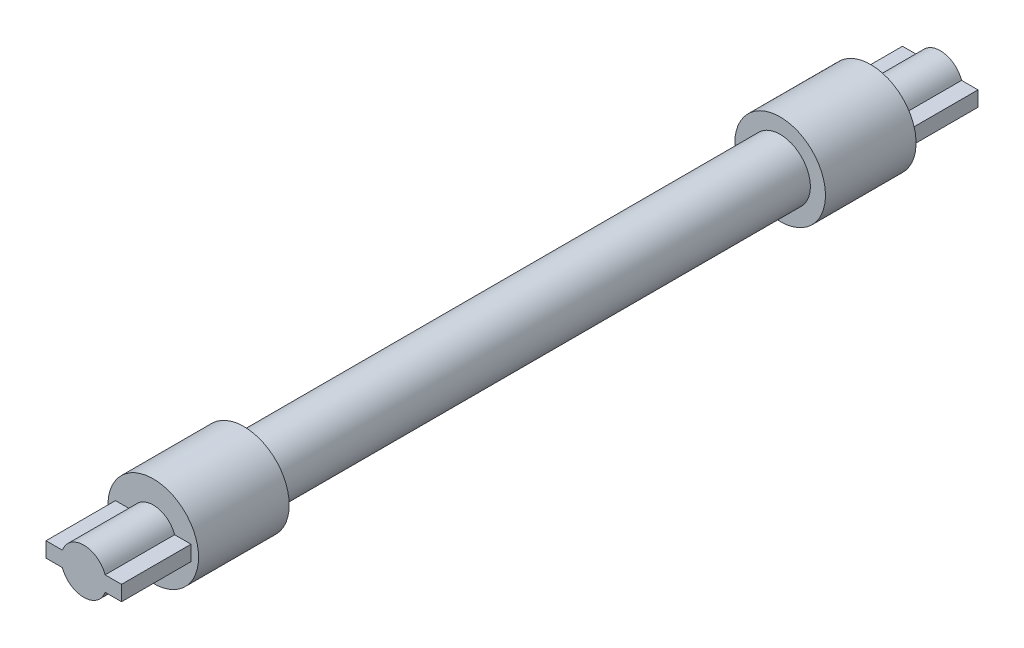
ISO-10303-21;
HEADER;
FILE_DESCRIPTION(('STEP AP214'),'2;1');
FILE_NAME('part.step','',(''),(''),'','','');
FILE_SCHEMA(('AUTOMOTIVE_DESIGN { 1 0 10303 214 1 1 1 1 }'));
ENDSEC;
DATA;
#1=APPLICATION_CONTEXT('core data for automotive mechanical design processes');
#2=APPLICATION_PROTOCOL_DEFINITION('international standard','automotive_design',2000,#1);
#3=PRODUCT_CONTEXT('',#1,'mechanical');
#4=PRODUCT('Part','Part','',(#3));
#5=PRODUCT_RELATED_PRODUCT_CATEGORY('part','',(#4));
#6=PRODUCT_DEFINITION_FORMATION('','',#4);
#7=PRODUCT_DEFINITION_CONTEXT('part definition',#1,'design');
#8=PRODUCT_DEFINITION('design','',#6,#7);
#9=PRODUCT_DEFINITION_SHAPE('','',#8);
#10=(LENGTH_UNIT() NAMED_UNIT(*) SI_UNIT(.MILLI.,.METRE.));
#11=(NAMED_UNIT(*) PLANE_ANGLE_UNIT() SI_UNIT($,.RADIAN.));
#12=(NAMED_UNIT(*) SI_UNIT($,.STERADIAN.) SOLID_ANGLE_UNIT());
#13=UNCERTAINTY_MEASURE_WITH_UNIT(LENGTH_MEASURE(1.E-05),#10,'distance_accuracy_value','');
#14=(GEOMETRIC_REPRESENTATION_CONTEXT(3) GLOBAL_UNCERTAINTY_ASSIGNED_CONTEXT((#13)) GLOBAL_UNIT_ASSIGNED_CONTEXT((#10,
#11,#12)) REPRESENTATION_CONTEXT('',''));
#15=CARTESIAN_POINT('',(0.,0.,0.));
#16=DIRECTION('',(0.,0.,1.));
#17=DIRECTION('',(1.,0.,0.));
#18=AXIS2_PLACEMENT_3D('',#15,#16,#17);
#19=CARTESIAN_POINT('',(0.,0.,-120.));
#20=DIRECTION('',(0.,0.,-1.));
#21=DIRECTION('',(-1.,0.,0.));
#22=AXIS2_PLACEMENT_3D('',#19,#20,#21);
#23=PLANE('',#22);
#24=CARTESIAN_POINT('',(0.,0.,-120.));
#25=DIRECTION('',(0.,0.,-1.));
#26=DIRECTION('',(-1.,0.,0.));
#27=AXIS2_PLACEMENT_3D('',#24,#25,#26);
#28=CIRCLE('',#27,60.);
#29=CARTESIAN_POINT('',(-60.,0.,-120.));
#30=VERTEX_POINT('',#29);
#31=EDGE_CURVE('E246',#30,#30,#28,.T.);
#32=ORIENTED_EDGE('',*,*,#31,.T.);
#33=EDGE_LOOP('',(#32));
#34=FACE_BOUND('',#33,.T.);
#35=DIRECTION('',(1.,0.,0.));
#36=VECTOR('',#35,1.);
#37=CARTESIAN_POINT('',(0.,10.,-120.));
#38=LINE('',#37,#36);
#39=CARTESIAN_POINT('',(28.2842712474619,10.,-120.));
#40=VERTEX_POINT('',#39);
#41=CARTESIAN_POINT('',(50.,10.,-120.));
#42=VERTEX_POINT('',#41);
#43=EDGE_CURVE('E480',#40,#42,#38,.T.);
#44=ORIENTED_EDGE('',*,*,#43,.F.);
#45=CARTESIAN_POINT('',(0.,0.,-120.));
#46=DIRECTION('',(0.,0.,-1.));
#47=DIRECTION('',(-1.,0.,0.));
#48=AXIS2_PLACEMENT_3D('',#45,#46,#47);
#49=CIRCLE('',#48,30.);
#50=CARTESIAN_POINT('',(-28.2842712474619,10.,-120.));
#51=VERTEX_POINT('',#50);
#52=EDGE_CURVE('E180',#51,#40,#49,.T.);
#53=ORIENTED_EDGE('',*,*,#52,.F.);
#54=DIRECTION('',(1.,0.,0.));
#55=VECTOR('',#54,1.);
#56=CARTESIAN_POINT('',(0.,10.,-120.));
#57=LINE('',#56,#55);
#58=CARTESIAN_POINT('',(-50.,10.,-120.));
#59=VERTEX_POINT('',#58);
#60=EDGE_CURVE('E176',#59,#51,#57,.T.);
#61=ORIENTED_EDGE('',*,*,#60,.F.);
#62=DIRECTION('',(0.,1.,0.));
#63=VECTOR('',#62,1.);
#64=CARTESIAN_POINT('',(-50.,0.,-120.));
#65=LINE('',#64,#63);
#66=CARTESIAN_POINT('',(-50.,-10.,-120.));
#67=VERTEX_POINT('',#66);
#68=EDGE_CURVE('E476',#67,#59,#65,.T.);
#69=ORIENTED_EDGE('',*,*,#68,.F.);
#70=DIRECTION('',(1.,0.,0.));
#71=VECTOR('',#70,1.);
#72=CARTESIAN_POINT('',(0.,-10.,-120.));
#73=LINE('',#72,#71);
#74=CARTESIAN_POINT('',(-28.2842712474619,-10.,-120.));
#75=VERTEX_POINT('',#74);
#76=EDGE_CURVE('E494',#67,#75,#73,.T.);
#77=ORIENTED_EDGE('',*,*,#76,.T.);
#78=CARTESIAN_POINT('',(0.,0.,-120.));
#79=DIRECTION('',(0.,0.,-1.));
#80=DIRECTION('',(-1.,0.,0.));
#81=AXIS2_PLACEMENT_3D('',#78,#79,#80);
#82=CIRCLE('',#81,30.);
#83=CARTESIAN_POINT('',(28.2842712474619,-10.,-120.));
#84=VERTEX_POINT('',#83);
#85=EDGE_CURVE('E491',#84,#75,#82,.T.);
#86=ORIENTED_EDGE('',*,*,#85,.F.);
#87=DIRECTION('',(1.,0.,0.));
#88=VECTOR('',#87,1.);
#89=CARTESIAN_POINT('',(0.,-10.,-120.));
#90=LINE('',#89,#88);
#91=CARTESIAN_POINT('',(50.,-10.,-120.));
#92=VERTEX_POINT('',#91);
#93=EDGE_CURVE('E488',#84,#92,#90,.T.);
#94=ORIENTED_EDGE('',*,*,#93,.T.);
#95=DIRECTION('',(0.,1.,0.));
#96=VECTOR('',#95,1.);
#97=CARTESIAN_POINT('',(50.,0.,-120.));
#98=LINE('',#97,#96);
#99=EDGE_CURVE('E482',#92,#42,#98,.T.);
#100=ORIENTED_EDGE('',*,*,#99,.T.);
#101=EDGE_LOOP('',(#44,#53,#61,#69,#77,#86,#94,#100));
#102=FACE_BOUND('',#101,.T.);
#103=ADVANCED_FACE('F43',(#34,#102),#23,.T.);
#104=CARTESIAN_POINT('',(0.,0.,830.));
#105=DIRECTION('',(0.,0.,1.));
#106=DIRECTION('',(1.,0.,0.));
#107=AXIS2_PLACEMENT_3D('',#104,#105,#106);
#108=PLANE('',#107);
#109=CARTESIAN_POINT('',(0.,0.,830.));
#110=DIRECTION('',(0.,0.,1.));
#111=DIRECTION('',(1.,0.,0.));
#112=AXIS2_PLACEMENT_3D('',#109,#110,#111);
#113=CIRCLE('',#112,60.);
#114=CARTESIAN_POINT('',(60.,0.,830.));
#115=VERTEX_POINT('',#114);
#116=EDGE_CURVE('E51',#115,#115,#113,.T.);
#117=ORIENTED_EDGE('',*,*,#116,.T.);
#118=EDGE_LOOP('',(#117));
#119=FACE_BOUND('',#118,.T.);
#120=CARTESIAN_POINT('',(0.,0.,830.));
#121=DIRECTION('',(0.,0.,1.));
#122=DIRECTION('',(1.,0.,0.));
#123=AXIS2_PLACEMENT_3D('',#120,#121,#122);
#124=CIRCLE('',#123,30.);
#125=CARTESIAN_POINT('',(-28.2842712474619,-10.,830.));
#126=VERTEX_POINT('',#125);
#127=CARTESIAN_POINT('',(28.2842712474619,-10.,830.));
#128=VERTEX_POINT('',#127);
#129=EDGE_CURVE('E185',#126,#128,#124,.T.);
#130=ORIENTED_EDGE('',*,*,#129,.F.);
#131=DIRECTION('',(1.,0.,0.));
#132=VECTOR('',#131,1.);
#133=CARTESIAN_POINT('',(0.,-10.,830.));
#134=LINE('',#133,#132);
#135=CARTESIAN_POINT('',(-50.,-10.,830.));
#136=VERTEX_POINT('',#135);
#137=EDGE_CURVE('E182',#136,#126,#134,.T.);
#138=ORIENTED_EDGE('',*,*,#137,.F.);
#139=DIRECTION('',(0.,-1.,0.));
#140=VECTOR('',#139,1.);
#141=CARTESIAN_POINT('',(-50.,0.,830.));
#142=LINE('',#141,#140);
#143=CARTESIAN_POINT('',(-50.,10.,830.));
#144=VERTEX_POINT('',#143);
#145=EDGE_CURVE('E195',#144,#136,#142,.T.);
#146=ORIENTED_EDGE('',*,*,#145,.F.);
#147=DIRECTION('',(1.,0.,0.));
#148=VECTOR('',#147,1.);
#149=CARTESIAN_POINT('',(0.,10.,830.));
#150=LINE('',#149,#148);
#151=CARTESIAN_POINT('',(-28.2842712474619,10.,830.));
#152=VERTEX_POINT('',#151);
#153=EDGE_CURVE('E66',#144,#152,#150,.T.);
#154=ORIENTED_EDGE('',*,*,#153,.T.);
#155=CARTESIAN_POINT('',(0.,0.,830.));
#156=DIRECTION('',(0.,0.,1.));
#157=DIRECTION('',(1.,0.,0.));
#158=AXIS2_PLACEMENT_3D('',#155,#156,#157);
#159=CIRCLE('',#158,30.);
#160=CARTESIAN_POINT('',(28.2842712474619,10.,830.));
#161=VERTEX_POINT('',#160);
#162=EDGE_CURVE('E223',#161,#152,#159,.T.);
#163=ORIENTED_EDGE('',*,*,#162,.F.);
#164=DIRECTION('',(1.,0.,0.));
#165=VECTOR('',#164,1.);
#166=CARTESIAN_POINT('',(0.,10.,830.));
#167=LINE('',#166,#165);
#168=CARTESIAN_POINT('',(50.,10.,830.));
#169=VERTEX_POINT('',#168);
#170=EDGE_CURVE('E220',#161,#169,#167,.T.);
#171=ORIENTED_EDGE('',*,*,#170,.T.);
#172=DIRECTION('',(0.,-1.,0.));
#173=VECTOR('',#172,1.);
#174=CARTESIAN_POINT('',(50.,0.,830.));
#175=LINE('',#174,#173);
#176=CARTESIAN_POINT('',(50.,-10.,830.));
#177=VERTEX_POINT('',#176);
#178=EDGE_CURVE('E217',#169,#177,#175,.T.);
#179=ORIENTED_EDGE('',*,*,#178,.T.);
#180=DIRECTION('',(1.,0.,0.));
#181=VECTOR('',#180,1.);
#182=CARTESIAN_POINT('',(0.,-10.,830.));
#183=LINE('',#182,#181);
#184=EDGE_CURVE('E214',#128,#177,#183,.T.);
#185=ORIENTED_EDGE('',*,*,#184,.F.);
#186=EDGE_LOOP('',(#130,#138,#146,#154,#163,#171,#179,#185));
#187=FACE_BOUND('',#186,.T.);
#188=ADVANCED_FACE('F276',(#119,#187),#108,.T.);
#189=CARTESIAN_POINT('',(0.,0.,710.));
#190=DIRECTION('',(0.,0.,-1.));
#191=DIRECTION('',(-1.,0.,0.));
#192=AXIS2_PLACEMENT_3D('',#189,#190,#191);
#193=CYLINDRICAL_SURFACE('',#192,40.);
#194=CARTESIAN_POINT('',(0.,0.,710.));
#195=DIRECTION('',(0.,0.,1.));
#196=DIRECTION('',(1.,0.,0.));
#197=AXIS2_PLACEMENT_3D('',#194,#195,#196);
#198=CIRCLE('',#197,40.);
#199=CARTESIAN_POINT('',(40.,0.,710.));
#200=VERTEX_POINT('',#199);
#201=EDGE_CURVE('E11',#200,#200,#198,.T.);
#202=ORIENTED_EDGE('',*,*,#201,.F.);
#203=EDGE_LOOP('',(#202));
#204=FACE_BOUND('',#203,.T.);
#205=CARTESIAN_POINT('',(0.,0.,0.));
#206=DIRECTION('',(0.,0.,-1.));
#207=DIRECTION('',(-1.,0.,0.));
#208=AXIS2_PLACEMENT_3D('',#205,#206,#207);
#209=CIRCLE('',#208,40.);
#210=CARTESIAN_POINT('',(-40.,0.,0.));
#211=VERTEX_POINT('',#210);
#212=EDGE_CURVE('E249',#211,#211,#209,.T.);
#213=ORIENTED_EDGE('',*,*,#212,.F.);
#214=EDGE_LOOP('',(#213));
#215=FACE_BOUND('',#214,.T.);
#216=ADVANCED_FACE('F45',(#204,#215),#193,.T.);
#217=CARTESIAN_POINT('',(0.,0.,830.));
#218=DIRECTION('',(0.,0.,-1.));
#219=DIRECTION('',(-1.,0.,0.));
#220=AXIS2_PLACEMENT_3D('',#217,#218,#219);
#221=CYLINDRICAL_SURFACE('',#220,60.);
#222=ORIENTED_EDGE('',*,*,#116,.F.);
#223=EDGE_LOOP('',(#222));
#224=FACE_BOUND('',#223,.T.);
#225=CARTESIAN_POINT('',(0.,0.,710.));
#226=DIRECTION('',(0.,0.,1.));
#227=DIRECTION('',(1.,0.,0.));
#228=AXIS2_PLACEMENT_3D('',#225,#226,#227);
#229=CIRCLE('',#228,60.);
#230=CARTESIAN_POINT('',(60.,0.,710.));
#231=VERTEX_POINT('',#230);
#232=EDGE_CURVE('E254',#231,#231,#229,.T.);
#233=ORIENTED_EDGE('',*,*,#232,.T.);
#234=EDGE_LOOP('',(#233));
#235=FACE_BOUND('',#234,.T.);
#236=ADVANCED_FACE('F259',(#224,#235),#221,.T.);
#237=CARTESIAN_POINT('',(0.,0.,710.));
#238=DIRECTION('',(0.,0.,1.));
#239=DIRECTION('',(1.,0.,0.));
#240=AXIS2_PLACEMENT_3D('',#237,#238,#239);
#241=PLANE('',#240);
#242=ORIENTED_EDGE('',*,*,#201,.T.);
#243=EDGE_LOOP('',(#242));
#244=FACE_BOUND('',#243,.T.);
#245=ORIENTED_EDGE('',*,*,#232,.F.);
#246=EDGE_LOOP('',(#245));
#247=FACE_BOUND('',#246,.T.);
#248=ADVANCED_FACE('F261',(#244,#247),#241,.F.);
#249=CARTESIAN_POINT('',(0.,0.,-120.));
#250=DIRECTION('',(0.,0.,1.));
#251=DIRECTION('',(1.,0.,0.));
#252=AXIS2_PLACEMENT_3D('',#249,#250,#251);
#253=CYLINDRICAL_SURFACE('',#252,60.);
#254=ORIENTED_EDGE('',*,*,#31,.F.);
#255=EDGE_LOOP('',(#254));
#256=FACE_BOUND('',#255,.T.);
#257=CARTESIAN_POINT('',(0.,0.,0.));
#258=DIRECTION('',(0.,0.,-1.));
#259=DIRECTION('',(-1.,0.,0.));
#260=AXIS2_PLACEMENT_3D('',#257,#258,#259);
#261=CIRCLE('',#260,60.);
#262=CARTESIAN_POINT('',(-60.,0.,0.));
#263=VERTEX_POINT('',#262);
#264=EDGE_CURVE('E245',#263,#263,#261,.T.);
#265=ORIENTED_EDGE('',*,*,#264,.T.);
#266=EDGE_LOOP('',(#265));
#267=FACE_BOUND('',#266,.T.);
#268=ADVANCED_FACE('F263',(#256,#267),#253,.T.);
#269=CARTESIAN_POINT('',(0.,0.,0.));
#270=DIRECTION('',(0.,0.,-1.));
#271=DIRECTION('',(-1.,0.,0.));
#272=AXIS2_PLACEMENT_3D('',#269,#270,#271);
#273=PLANE('',#272);
#274=ORIENTED_EDGE('',*,*,#212,.T.);
#275=EDGE_LOOP('',(#274));
#276=FACE_BOUND('',#275,.T.);
#277=ORIENTED_EDGE('',*,*,#264,.F.);
#278=EDGE_LOOP('',(#277));
#279=FACE_BOUND('',#278,.T.);
#280=ADVANCED_FACE('F270',(#276,#279),#273,.F.);
#281=CARTESIAN_POINT('',(0.,-10.,922.));
#282=DIRECTION('',(0.,1.,0.));
#283=DIRECTION('',(0.,0.,1.));
#284=AXIS2_PLACEMENT_3D('',#281,#282,#283);
#285=PLANE('',#284);
#286=ORIENTED_EDGE('',*,*,#137,.T.);
#287=DIRECTION('',(0.,0.,-1.));
#288=VECTOR('',#287,1.);
#289=CARTESIAN_POINT('',(-28.2842712474619,-10.,922.));
#290=LINE('',#289,#288);
#291=CARTESIAN_POINT('',(-28.2842712474619,-10.,922.));
#292=VERTEX_POINT('',#291);
#293=EDGE_CURVE('E243',#292,#126,#290,.T.);
#294=ORIENTED_EDGE('',*,*,#293,.F.);
#295=DIRECTION('',(1.,0.,0.));
#296=VECTOR('',#295,1.);
#297=CARTESIAN_POINT('',(0.,-10.,922.));
#298=LINE('',#297,#296);
#299=CARTESIAN_POINT('',(-50.,-10.,922.));
#300=VERTEX_POINT('',#299);
#301=EDGE_CURVE('E191',#300,#292,#298,.T.);
#302=ORIENTED_EDGE('',*,*,#301,.F.);
#303=DIRECTION('',(0.,0.,-1.));
#304=VECTOR('',#303,1.);
#305=CARTESIAN_POINT('',(-50.,-10.,922.));
#306=LINE('',#305,#304);
#307=EDGE_CURVE('E211',#300,#136,#306,.T.);
#308=ORIENTED_EDGE('',*,*,#307,.T.);
#309=EDGE_LOOP('',(#286,#294,#302,#308));
#310=FACE_BOUND('',#309,.T.);
#311=ADVANCED_FACE('F288',(#310),#285,.F.);
#312=CARTESIAN_POINT('',(0.,0.,922.));
#313=DIRECTION('',(0.,0.,-1.));
#314=DIRECTION('',(-1.,0.,0.));
#315=AXIS2_PLACEMENT_3D('',#312,#313,#314);
#316=CYLINDRICAL_SURFACE('',#315,30.);
#317=ORIENTED_EDGE('',*,*,#129,.T.);
#318=DIRECTION('',(0.,0.,-1.));
#319=VECTOR('',#318,1.);
#320=CARTESIAN_POINT('',(28.2842712474619,-10.,922.));
#321=LINE('',#320,#319);
#322=CARTESIAN_POINT('',(28.2842712474619,-10.,922.));
#323=VERTEX_POINT('',#322);
#324=EDGE_CURVE('E240',#323,#128,#321,.T.);
#325=ORIENTED_EDGE('',*,*,#324,.F.);
#326=CARTESIAN_POINT('',(0.,0.,922.));
#327=DIRECTION('',(0.,0.,1.));
#328=DIRECTION('',(1.,0.,0.));
#329=AXIS2_PLACEMENT_3D('',#326,#327,#328);
#330=CIRCLE('',#329,30.);
#331=EDGE_CURVE('E194',#292,#323,#330,.T.);
#332=ORIENTED_EDGE('',*,*,#331,.F.);
#333=ORIENTED_EDGE('',*,*,#293,.T.);
#334=EDGE_LOOP('',(#317,#325,#332,#333));
#335=FACE_BOUND('',#334,.T.);
#336=ADVANCED_FACE('F295',(#335),#316,.T.);
#337=CARTESIAN_POINT('',(0.,-10.,922.));
#338=DIRECTION('',(0.,1.,0.));
#339=DIRECTION('',(0.,0.,1.));
#340=AXIS2_PLACEMENT_3D('',#337,#338,#339);
#341=PLANE('',#340);
#342=ORIENTED_EDGE('',*,*,#184,.T.);
#343=DIRECTION('',(0.,0.,-1.));
#344=VECTOR('',#343,1.);
#345=CARTESIAN_POINT('',(50.,-10.,922.));
#346=LINE('',#345,#344);
#347=CARTESIAN_POINT('',(50.,-10.,922.));
#348=VERTEX_POINT('',#347);
#349=EDGE_CURVE('E238',#348,#177,#346,.T.);
#350=ORIENTED_EDGE('',*,*,#349,.F.);
#351=DIRECTION('',(1.,0.,0.));
#352=VECTOR('',#351,1.);
#353=CARTESIAN_POINT('',(0.,-10.,922.));
#354=LINE('',#353,#352);
#355=EDGE_CURVE('E197',#323,#348,#354,.T.);
#356=ORIENTED_EDGE('',*,*,#355,.F.);
#357=ORIENTED_EDGE('',*,*,#324,.T.);
#358=EDGE_LOOP('',(#342,#350,#356,#357));
#359=FACE_BOUND('',#358,.T.);
#360=ADVANCED_FACE('F334',(#359),#341,.F.);
#361=CARTESIAN_POINT('',(50.,0.,922.));
#362=DIRECTION('',(1.,0.,0.));
#363=DIRECTION('',(0.,0.,-1.));
#364=AXIS2_PLACEMENT_3D('',#361,#362,#363);
#365=PLANE('',#364);
#366=ORIENTED_EDGE('',*,*,#178,.F.);
#367=DIRECTION('',(0.,0.,-1.));
#368=VECTOR('',#367,1.);
#369=CARTESIAN_POINT('',(50.,10.,922.));
#370=LINE('',#369,#368);
#371=CARTESIAN_POINT('',(50.,10.,922.));
#372=VERTEX_POINT('',#371);
#373=EDGE_CURVE('E236',#372,#169,#370,.T.);
#374=ORIENTED_EDGE('',*,*,#373,.F.);
#375=DIRECTION('',(0.,-1.,0.));
#376=VECTOR('',#375,1.);
#377=CARTESIAN_POINT('',(50.,0.,922.));
#378=LINE('',#377,#376);
#379=EDGE_CURVE('E199',#372,#348,#378,.T.);
#380=ORIENTED_EDGE('',*,*,#379,.T.);
#381=ORIENTED_EDGE('',*,*,#349,.T.);
#382=EDGE_LOOP('',(#366,#374,#380,#381));
#383=FACE_BOUND('',#382,.T.);
#384=ADVANCED_FACE('F341',(#383),#365,.T.);
#385=CARTESIAN_POINT('',(0.,10.,922.));
#386=DIRECTION('',(0.,1.,0.));
#387=DIRECTION('',(0.,0.,1.));
#388=AXIS2_PLACEMENT_3D('',#385,#386,#387);
#389=PLANE('',#388);
#390=ORIENTED_EDGE('',*,*,#170,.F.);
#391=DIRECTION('',(0.,0.,-1.));
#392=VECTOR('',#391,1.);
#393=CARTESIAN_POINT('',(28.2842712474619,10.,922.));
#394=LINE('',#393,#392);
#395=CARTESIAN_POINT('',(28.2842712474619,10.,922.));
#396=VERTEX_POINT('',#395);
#397=EDGE_CURVE('E234',#396,#161,#394,.T.);
#398=ORIENTED_EDGE('',*,*,#397,.F.);
#399=DIRECTION('',(1.,0.,0.));
#400=VECTOR('',#399,1.);
#401=CARTESIAN_POINT('',(0.,10.,922.));
#402=LINE('',#401,#400);
#403=EDGE_CURVE('E202',#396,#372,#402,.T.);
#404=ORIENTED_EDGE('',*,*,#403,.T.);
#405=ORIENTED_EDGE('',*,*,#373,.T.);
#406=EDGE_LOOP('',(#390,#398,#404,#405));
#407=FACE_BOUND('',#406,.T.);
#408=ADVANCED_FACE('F349',(#407),#389,.T.);
#409=CARTESIAN_POINT('',(0.,0.,922.));
#410=DIRECTION('',(0.,0.,-1.));
#411=DIRECTION('',(-1.,0.,0.));
#412=AXIS2_PLACEMENT_3D('',#409,#410,#411);
#413=CYLINDRICAL_SURFACE('',#412,30.);
#414=ORIENTED_EDGE('',*,*,#162,.T.);
#415=DIRECTION('',(0.,0.,-1.));
#416=VECTOR('',#415,1.);
#417=CARTESIAN_POINT('',(-28.2842712474619,10.,922.));
#418=LINE('',#417,#416);
#419=CARTESIAN_POINT('',(-28.2842712474619,10.,922.));
#420=VERTEX_POINT('',#419);
#421=EDGE_CURVE('E232',#420,#152,#418,.T.);
#422=ORIENTED_EDGE('',*,*,#421,.F.);
#423=CARTESIAN_POINT('',(0.,0.,922.));
#424=DIRECTION('',(0.,0.,1.));
#425=DIRECTION('',(1.,0.,0.));
#426=AXIS2_PLACEMENT_3D('',#423,#424,#425);
#427=CIRCLE('',#426,30.);
#428=EDGE_CURVE('E205',#396,#420,#427,.T.);
#429=ORIENTED_EDGE('',*,*,#428,.F.);
#430=ORIENTED_EDGE('',*,*,#397,.T.);
#431=EDGE_LOOP('',(#414,#422,#429,#430));
#432=FACE_BOUND('',#431,.T.);
#433=ADVANCED_FACE('F357',(#432),#413,.T.);
#434=CARTESIAN_POINT('',(0.,10.,922.));
#435=DIRECTION('',(0.,1.,0.));
#436=DIRECTION('',(0.,0.,1.));
#437=AXIS2_PLACEMENT_3D('',#434,#435,#436);
#438=PLANE('',#437);
#439=ORIENTED_EDGE('',*,*,#153,.F.);
#440=DIRECTION('',(0.,0.,-1.));
#441=VECTOR('',#440,1.);
#442=CARTESIAN_POINT('',(-50.,10.,922.));
#443=LINE('',#442,#441);
#444=CARTESIAN_POINT('',(-50.,10.,922.));
#445=VERTEX_POINT('',#444);
#446=EDGE_CURVE('E230',#445,#144,#443,.T.);
#447=ORIENTED_EDGE('',*,*,#446,.F.);
#448=DIRECTION('',(1.,0.,0.));
#449=VECTOR('',#448,1.);
#450=CARTESIAN_POINT('',(0.,10.,922.));
#451=LINE('',#450,#449);
#452=EDGE_CURVE('E207',#445,#420,#451,.T.);
#453=ORIENTED_EDGE('',*,*,#452,.T.);
#454=ORIENTED_EDGE('',*,*,#421,.T.);
#455=EDGE_LOOP('',(#439,#447,#453,#454));
#456=FACE_BOUND('',#455,.T.);
#457=ADVANCED_FACE('F365',(#456),#438,.T.);
#458=CARTESIAN_POINT('',(-50.,0.,922.));
#459=DIRECTION('',(1.,0.,0.));
#460=DIRECTION('',(0.,0.,-1.));
#461=AXIS2_PLACEMENT_3D('',#458,#459,#460);
#462=PLANE('',#461);
#463=ORIENTED_EDGE('',*,*,#145,.T.);
#464=ORIENTED_EDGE('',*,*,#307,.F.);
#465=DIRECTION('',(0.,-1.,0.));
#466=VECTOR('',#465,1.);
#467=CARTESIAN_POINT('',(-50.,0.,922.));
#468=LINE('',#467,#466);
#469=EDGE_CURVE('E210',#445,#300,#468,.T.);
#470=ORIENTED_EDGE('',*,*,#469,.F.);
#471=ORIENTED_EDGE('',*,*,#446,.T.);
#472=EDGE_LOOP('',(#463,#464,#470,#471));
#473=FACE_BOUND('',#472,.T.);
#474=ADVANCED_FACE('F373',(#473),#462,.F.);
#475=CARTESIAN_POINT('',(0.,0.,922.));
#476=DIRECTION('',(0.,0.,1.));
#477=DIRECTION('',(1.,0.,0.));
#478=AXIS2_PLACEMENT_3D('',#475,#476,#477);
#479=PLANE('',#478);
#480=ORIENTED_EDGE('',*,*,#301,.T.);
#481=ORIENTED_EDGE('',*,*,#331,.T.);
#482=ORIENTED_EDGE('',*,*,#355,.T.);
#483=ORIENTED_EDGE('',*,*,#379,.F.);
#484=ORIENTED_EDGE('',*,*,#403,.F.);
#485=ORIENTED_EDGE('',*,*,#428,.T.);
#486=ORIENTED_EDGE('',*,*,#452,.F.);
#487=ORIENTED_EDGE('',*,*,#469,.T.);
#488=EDGE_LOOP('',(#480,#481,#482,#483,#484,#485,#486,#487));
#489=FACE_BOUND('',#488,.T.);
#490=ADVANCED_FACE('F380',(#489),#479,.T.);
#491=CARTESIAN_POINT('',(0.,0.,-212.));
#492=DIRECTION('',(0.,0.,1.));
#493=DIRECTION('',(1.,0.,0.));
#494=AXIS2_PLACEMENT_3D('',#491,#492,#493);
#495=CYLINDRICAL_SURFACE('',#494,30.);
#496=ORIENTED_EDGE('',*,*,#52,.T.);
#497=DIRECTION('',(0.,0.,1.));
#498=VECTOR('',#497,1.);
#499=CARTESIAN_POINT('',(28.2842712474619,10.,-212.));
#500=LINE('',#499,#498);
#501=CARTESIAN_POINT('',(28.2842712474619,10.,-212.));
#502=VERTEX_POINT('',#501);
#503=EDGE_CURVE('E161',#502,#40,#500,.T.);
#504=ORIENTED_EDGE('',*,*,#503,.F.);
#505=CARTESIAN_POINT('',(0.,0.,-212.));
#506=DIRECTION('',(0.,0.,-1.));
#507=DIRECTION('',(-1.,0.,0.));
#508=AXIS2_PLACEMENT_3D('',#505,#506,#507);
#509=CIRCLE('',#508,30.);
#510=CARTESIAN_POINT('',(-28.2842712474619,10.,-212.));
#511=VERTEX_POINT('',#510);
#512=EDGE_CURVE('E168',#511,#502,#509,.T.);
#513=ORIENTED_EDGE('',*,*,#512,.F.);
#514=DIRECTION('',(0.,0.,1.));
#515=VECTOR('',#514,1.);
#516=CARTESIAN_POINT('',(-28.2842712474619,10.,-212.));
#517=LINE('',#516,#515);
#518=EDGE_CURVE('E474',#511,#51,#517,.T.);
#519=ORIENTED_EDGE('',*,*,#518,.T.);
#520=EDGE_LOOP('',(#496,#504,#513,#519));
#521=FACE_BOUND('',#520,.T.);
#522=ADVANCED_FACE('F178',(#521),#495,.T.);
#523=CARTESIAN_POINT('',(0.,10.,-212.));
#524=DIRECTION('',(0.,-1.,0.));
#525=DIRECTION('',(0.,0.,-1.));
#526=AXIS2_PLACEMENT_3D('',#523,#524,#525);
#527=PLANE('',#526);
#528=ORIENTED_EDGE('',*,*,#43,.T.);
#529=DIRECTION('',(0.,0.,1.));
#530=VECTOR('',#529,1.);
#531=CARTESIAN_POINT('',(50.,10.,-212.));
#532=LINE('',#531,#530);
#533=CARTESIAN_POINT('',(50.,10.,-212.));
#534=VERTEX_POINT('',#533);
#535=EDGE_CURVE('E163',#534,#42,#532,.T.);
#536=ORIENTED_EDGE('',*,*,#535,.F.);
#537=DIRECTION('',(1.,0.,0.));
#538=VECTOR('',#537,1.);
#539=CARTESIAN_POINT('',(0.,10.,-212.));
#540=LINE('',#539,#538);
#541=EDGE_CURVE('E156',#502,#534,#540,.T.);
#542=ORIENTED_EDGE('',*,*,#541,.F.);
#543=ORIENTED_EDGE('',*,*,#503,.T.);
#544=EDGE_LOOP('',(#528,#536,#542,#543));
#545=FACE_BOUND('',#544,.T.);
#546=ADVANCED_FACE('F159',(#545),#527,.F.);
#547=CARTESIAN_POINT('',(50.,0.,-212.));
#548=DIRECTION('',(1.,0.,0.));
#549=DIRECTION('',(0.,0.,-1.));
#550=AXIS2_PLACEMENT_3D('',#547,#548,#549);
#551=PLANE('',#550);
#552=ORIENTED_EDGE('',*,*,#99,.F.);
#553=DIRECTION('',(0.,0.,1.));
#554=VECTOR('',#553,1.);
#555=CARTESIAN_POINT('',(50.,-10.,-212.));
#556=LINE('',#555,#554);
#557=CARTESIAN_POINT('',(50.,-10.,-212.));
#558=VERTEX_POINT('',#557);
#559=EDGE_CURVE('E187',#558,#92,#556,.T.);
#560=ORIENTED_EDGE('',*,*,#559,.F.);
#561=DIRECTION('',(0.,1.,0.));
#562=VECTOR('',#561,1.);
#563=CARTESIAN_POINT('',(50.,0.,-212.));
#564=LINE('',#563,#562);
#565=EDGE_CURVE('E167',#558,#534,#564,.T.);
#566=ORIENTED_EDGE('',*,*,#565,.T.);
#567=ORIENTED_EDGE('',*,*,#535,.T.);
#568=EDGE_LOOP('',(#552,#560,#566,#567));
#569=FACE_BOUND('',#568,.T.);
#570=ADVANCED_FACE('F410',(#569),#551,.T.);
#571=CARTESIAN_POINT('',(0.,-10.,-212.));
#572=DIRECTION('',(0.,-1.,0.));
#573=DIRECTION('',(0.,0.,-1.));
#574=AXIS2_PLACEMENT_3D('',#571,#572,#573);
#575=PLANE('',#574);
#576=ORIENTED_EDGE('',*,*,#93,.F.);
#577=DIRECTION('',(0.,0.,1.));
#578=VECTOR('',#577,1.);
#579=CARTESIAN_POINT('',(28.2842712474619,-10.,-212.));
#580=LINE('',#579,#578);
#581=CARTESIAN_POINT('',(28.2842712474619,-10.,-212.));
#582=VERTEX_POINT('',#581);
#583=EDGE_CURVE('E503',#582,#84,#580,.T.);
#584=ORIENTED_EDGE('',*,*,#583,.F.);
#585=DIRECTION('',(1.,0.,0.));
#586=VECTOR('',#585,1.);
#587=CARTESIAN_POINT('',(0.,-10.,-212.));
#588=LINE('',#587,#586);
#589=EDGE_CURVE('E509',#582,#558,#588,.T.);
#590=ORIENTED_EDGE('',*,*,#589,.T.);
#591=ORIENTED_EDGE('',*,*,#559,.T.);
#592=EDGE_LOOP('',(#576,#584,#590,#591));
#593=FACE_BOUND('',#592,.T.);
#594=ADVANCED_FACE('F417',(#593),#575,.T.);
#595=CARTESIAN_POINT('',(0.,0.,-212.));
#596=DIRECTION('',(0.,0.,1.));
#597=DIRECTION('',(1.,0.,0.));
#598=AXIS2_PLACEMENT_3D('',#595,#596,#597);
#599=CYLINDRICAL_SURFACE('',#598,30.);
#600=ORIENTED_EDGE('',*,*,#85,.T.);
#601=DIRECTION('',(0.,0.,1.));
#602=VECTOR('',#601,1.);
#603=CARTESIAN_POINT('',(-28.2842712474619,-10.,-212.));
#604=LINE('',#603,#602);
#605=CARTESIAN_POINT('',(-28.2842712474619,-10.,-212.));
#606=VERTEX_POINT('',#605);
#607=EDGE_CURVE('E501',#606,#75,#604,.T.);
#608=ORIENTED_EDGE('',*,*,#607,.F.);
#609=CARTESIAN_POINT('',(0.,0.,-212.));
#610=DIRECTION('',(0.,0.,-1.));
#611=DIRECTION('',(-1.,0.,0.));
#612=AXIS2_PLACEMENT_3D('',#609,#610,#611);
#613=CIRCLE('',#612,30.);
#614=EDGE_CURVE('E514',#582,#606,#613,.T.);
#615=ORIENTED_EDGE('',*,*,#614,.F.);
#616=ORIENTED_EDGE('',*,*,#583,.T.);
#617=EDGE_LOOP('',(#600,#608,#615,#616));
#618=FACE_BOUND('',#617,.T.);
#619=ADVANCED_FACE('F425',(#618),#599,.T.);
#620=CARTESIAN_POINT('',(0.,-10.,-212.));
#621=DIRECTION('',(0.,-1.,0.));
#622=DIRECTION('',(0.,0.,-1.));
#623=AXIS2_PLACEMENT_3D('',#620,#621,#622);
#624=PLANE('',#623);
#625=ORIENTED_EDGE('',*,*,#76,.F.);
#626=DIRECTION('',(0.,0.,1.));
#627=VECTOR('',#626,1.);
#628=CARTESIAN_POINT('',(-50.,-10.,-212.));
#629=LINE('',#628,#627);
#630=CARTESIAN_POINT('',(-50.,-10.,-212.));
#631=VERTEX_POINT('',#630);
#632=EDGE_CURVE('E499',#631,#67,#629,.T.);
#633=ORIENTED_EDGE('',*,*,#632,.F.);
#634=DIRECTION('',(1.,0.,0.));
#635=VECTOR('',#634,1.);
#636=CARTESIAN_POINT('',(0.,-10.,-212.));
#637=LINE('',#636,#635);
#638=EDGE_CURVE('E516',#631,#606,#637,.T.);
#639=ORIENTED_EDGE('',*,*,#638,.T.);
#640=ORIENTED_EDGE('',*,*,#607,.T.);
#641=EDGE_LOOP('',(#625,#633,#639,#640));
#642=FACE_BOUND('',#641,.T.);
#643=ADVANCED_FACE('F433',(#642),#624,.T.);
#644=CARTESIAN_POINT('',(-50.,0.,-212.));
#645=DIRECTION('',(1.,0.,0.));
#646=DIRECTION('',(0.,0.,-1.));
#647=AXIS2_PLACEMENT_3D('',#644,#645,#646);
#648=PLANE('',#647);
#649=ORIENTED_EDGE('',*,*,#68,.T.);
#650=DIRECTION('',(0.,0.,1.));
#651=VECTOR('',#650,1.);
#652=CARTESIAN_POINT('',(-50.,10.,-212.));
#653=LINE('',#652,#651);
#654=CARTESIAN_POINT('',(-50.,10.,-212.));
#655=VERTEX_POINT('',#654);
#656=EDGE_CURVE('E58',#655,#59,#653,.T.);
#657=ORIENTED_EDGE('',*,*,#656,.F.);
#658=DIRECTION('',(0.,1.,0.));
#659=VECTOR('',#658,1.);
#660=CARTESIAN_POINT('',(-50.,0.,-212.));
#661=LINE('',#660,#659);
#662=EDGE_CURVE('E521',#631,#655,#661,.T.);
#663=ORIENTED_EDGE('',*,*,#662,.F.);
#664=ORIENTED_EDGE('',*,*,#632,.T.);
#665=EDGE_LOOP('',(#649,#657,#663,#664));
#666=FACE_BOUND('',#665,.T.);
#667=ADVANCED_FACE('F441',(#666),#648,.F.);
#668=CARTESIAN_POINT('',(0.,10.,-212.));
#669=DIRECTION('',(0.,-1.,0.));
#670=DIRECTION('',(0.,0.,-1.));
#671=AXIS2_PLACEMENT_3D('',#668,#669,#670);
#672=PLANE('',#671);
#673=ORIENTED_EDGE('',*,*,#60,.T.);
#674=ORIENTED_EDGE('',*,*,#518,.F.);
#675=DIRECTION('',(1.,0.,0.));
#676=VECTOR('',#675,1.);
#677=CARTESIAN_POINT('',(0.,10.,-212.));
#678=LINE('',#677,#676);
#679=EDGE_CURVE('E172',#655,#511,#678,.T.);
#680=ORIENTED_EDGE('',*,*,#679,.F.);
#681=ORIENTED_EDGE('',*,*,#656,.T.);
#682=EDGE_LOOP('',(#673,#674,#680,#681));
#683=FACE_BOUND('',#682,.T.);
#684=ADVANCED_FACE('F449',(#683),#672,.F.);
#685=CARTESIAN_POINT('',(0.,0.,-212.));
#686=DIRECTION('',(0.,0.,-1.));
#687=DIRECTION('',(-1.,0.,0.));
#688=AXIS2_PLACEMENT_3D('',#685,#686,#687);
#689=PLANE('',#688);
#690=ORIENTED_EDGE('',*,*,#512,.T.);
#691=ORIENTED_EDGE('',*,*,#541,.T.);
#692=ORIENTED_EDGE('',*,*,#565,.F.);
#693=ORIENTED_EDGE('',*,*,#589,.F.);
#694=ORIENTED_EDGE('',*,*,#614,.T.);
#695=ORIENTED_EDGE('',*,*,#638,.F.);
#696=ORIENTED_EDGE('',*,*,#662,.T.);
#697=ORIENTED_EDGE('',*,*,#679,.T.);
#698=EDGE_LOOP('',(#690,#691,#692,#693,#694,#695,#696,#697));
#699=FACE_BOUND('',#698,.T.);
#700=ADVANCED_FACE('F171',(#699),#689,.T.);
#701=CLOSED_SHELL('',(#103,#188,#216,#236,#248,#268,#280,#311,#336,#360,#384,#408,#433,#457,
#474,#490,#522,#546,#570,#594,#619,#643,#667,#684,#700));
#702=MANIFOLD_SOLID_BREP('B2',#701);
#703=ADVANCED_BREP_SHAPE_REPRESENTATION('',(#18,#702),#14);
#704=SHAPE_DEFINITION_REPRESENTATION(#9,#703);
ENDSEC;
END-ISO-10303-21;
